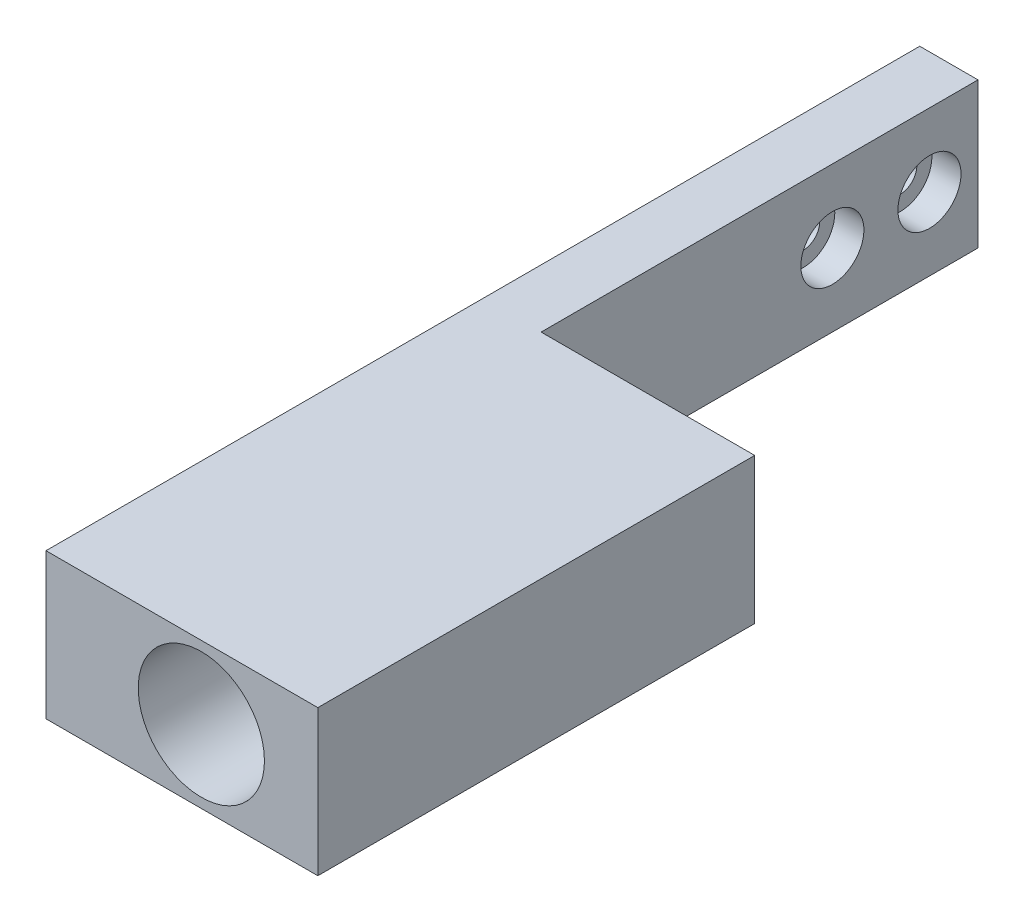
ISO-10303-21;
HEADER;
FILE_DESCRIPTION(('STEP AP214'),'2;1');
FILE_NAME('part.step','',(''),(''),'','','');
FILE_SCHEMA(('AUTOMOTIVE_DESIGN { 1 0 10303 214 1 1 1 1 }'));
ENDSEC;
DATA;
#1=APPLICATION_CONTEXT('core data for automotive mechanical design processes');
#2=APPLICATION_PROTOCOL_DEFINITION('international standard','automotive_design',2000,#1);
#3=PRODUCT_CONTEXT('',#1,'mechanical');
#4=PRODUCT('Part','Part','',(#3));
#5=PRODUCT_RELATED_PRODUCT_CATEGORY('part','',(#4));
#6=PRODUCT_DEFINITION_FORMATION('','',#4);
#7=PRODUCT_DEFINITION_CONTEXT('part definition',#1,'design');
#8=PRODUCT_DEFINITION('design','',#6,#7);
#9=PRODUCT_DEFINITION_SHAPE('','',#8);
#10=(LENGTH_UNIT() NAMED_UNIT(*) SI_UNIT(.MILLI.,.METRE.));
#11=(NAMED_UNIT(*) PLANE_ANGLE_UNIT() SI_UNIT($,.RADIAN.));
#12=(NAMED_UNIT(*) SI_UNIT($,.STERADIAN.) SOLID_ANGLE_UNIT());
#13=UNCERTAINTY_MEASURE_WITH_UNIT(LENGTH_MEASURE(1.E-05),#10,'distance_accuracy_value','');
#14=(GEOMETRIC_REPRESENTATION_CONTEXT(3) GLOBAL_UNCERTAINTY_ASSIGNED_CONTEXT((#13)) GLOBAL_UNIT_ASSIGNED_CONTEXT((#10,
#11,#12)) REPRESENTATION_CONTEXT('',''));
#15=CARTESIAN_POINT('',(0.,0.,0.));
#16=DIRECTION('',(0.,0.,1.));
#17=DIRECTION('',(1.,0.,0.));
#18=AXIS2_PLACEMENT_3D('',#15,#16,#17);
#19=CARTESIAN_POINT('',(115.8,0.,0.));
#20=DIRECTION('',(-1.,0.,0.));
#21=DIRECTION('',(0.,0.,1.));
#22=AXIS2_PLACEMENT_3D('',#19,#20,#21);
#23=PLANE('',#22);
#24=CARTESIAN_POINT('',(115.8,0.,5.));
#25=DIRECTION('',(1.,0.,0.));
#26=DIRECTION('',(0.,0.,-1.));
#27=AXIS2_PLACEMENT_3D('',#24,#25,#26);
#28=CIRCLE('',#27,3.25);
#29=CARTESIAN_POINT('',(115.8,0.,1.75));
#30=VERTEX_POINT('',#29);
#31=EDGE_CURVE('E191',#30,#30,#28,.T.);
#32=ORIENTED_EDGE('',*,*,#31,.F.);
#33=EDGE_LOOP('',(#32));
#34=FACE_BOUND('',#33,.T.);
#35=DIRECTION('',(0.,0.,1.));
#36=VECTOR('',#35,1.);
#37=CARTESIAN_POINT('',(115.8,7.5,10.));
#38=LINE('',#37,#36);
#39=CARTESIAN_POINT('',(115.8,7.5,-10.));
#40=VERTEX_POINT('',#39);
#41=CARTESIAN_POINT('',(115.8,7.5,35.));
#42=VERTEX_POINT('',#41);
#43=EDGE_CURVE('E142',#40,#42,#38,.T.);
#44=ORIENTED_EDGE('',*,*,#43,.T.);
#45=DIRECTION('',(0.,-1.,0.));
#46=VECTOR('',#45,1.);
#47=CARTESIAN_POINT('',(115.8,0.,35.));
#48=LINE('',#47,#46);
#49=CARTESIAN_POINT('',(115.8,-7.5,35.));
#50=VERTEX_POINT('',#49);
#51=EDGE_CURVE('E113',#42,#50,#48,.T.);
#52=ORIENTED_EDGE('',*,*,#51,.T.);
#53=DIRECTION('',(0.,0.,-1.));
#54=VECTOR('',#53,1.);
#55=CARTESIAN_POINT('',(115.8,-7.5,10.));
#56=LINE('',#55,#54);
#57=CARTESIAN_POINT('',(115.8,-7.5,-10.));
#58=VERTEX_POINT('',#57);
#59=EDGE_CURVE('E100',#50,#58,#56,.T.);
#60=ORIENTED_EDGE('',*,*,#59,.T.);
#61=DIRECTION('',(0.,1.,0.));
#62=VECTOR('',#61,1.);
#63=CARTESIAN_POINT('',(115.8,-7.5,-10.));
#64=LINE('',#63,#62);
#65=EDGE_CURVE('E139',#58,#40,#64,.T.);
#66=ORIENTED_EDGE('',*,*,#65,.T.);
#67=EDGE_LOOP('',(#44,#52,#60,#66));
#68=FACE_BOUND('',#67,.T.);
#69=CARTESIAN_POINT('',(115.8,0.,-5.00000000000001));
#70=DIRECTION('',(1.,0.,0.));
#71=DIRECTION('',(0.,0.,-1.));
#72=AXIS2_PLACEMENT_3D('',#69,#70,#71);
#73=CIRCLE('',#72,3.25);
#74=CARTESIAN_POINT('',(115.8,0.,-8.25));
#75=VERTEX_POINT('',#74);
#76=EDGE_CURVE('E181',#75,#75,#73,.T.);
#77=ORIENTED_EDGE('',*,*,#76,.F.);
#78=EDGE_LOOP('',(#77));
#79=FACE_BOUND('',#78,.T.);
#80=ADVANCED_FACE('F42',(#34,#68,#79),#23,.F.);
#81=CARTESIAN_POINT('',(109.8,7.5,45.));
#82=DIRECTION('',(1.,0.,0.));
#83=DIRECTION('',(0.,0.,-1.));
#84=AXIS2_PLACEMENT_3D('',#81,#82,#83);
#85=PLANE('',#84);
#86=CARTESIAN_POINT('',(109.8,0.,5.));
#87=DIRECTION('',(1.,0.,0.));
#88=DIRECTION('',(0.,0.,-1.));
#89=AXIS2_PLACEMENT_3D('',#86,#87,#88);
#90=CIRCLE('',#89,1.7);
#91=CARTESIAN_POINT('',(109.8,0.,3.3));
#92=VERTEX_POINT('',#91);
#93=EDGE_CURVE('E183',#92,#92,#90,.F.);
#94=ORIENTED_EDGE('',*,*,#93,.F.);
#95=EDGE_LOOP('',(#94));
#96=FACE_BOUND('',#95,.T.);
#97=DIRECTION('',(0.,0.,-1.));
#98=VECTOR('',#97,1.);
#99=CARTESIAN_POINT('',(109.8,7.5,45.));
#100=LINE('',#99,#98);
#101=CARTESIAN_POINT('',(109.8,7.5,80.));
#102=VERTEX_POINT('',#101);
#103=CARTESIAN_POINT('',(109.8,7.5,-10.));
#104=VERTEX_POINT('',#103);
#105=EDGE_CURVE('E57',#102,#104,#100,.T.);
#106=ORIENTED_EDGE('',*,*,#105,.T.);
#107=DIRECTION('',(0.,1.,0.));
#108=VECTOR('',#107,1.);
#109=CARTESIAN_POINT('',(109.8,-7.5,-10.));
#110=LINE('',#109,#108);
#111=CARTESIAN_POINT('',(109.8,-7.5,-10.));
#112=VERTEX_POINT('',#111);
#113=EDGE_CURVE('E11',#112,#104,#110,.T.);
#114=ORIENTED_EDGE('',*,*,#113,.F.);
#115=DIRECTION('',(0.,0.,-1.));
#116=VECTOR('',#115,1.);
#117=CARTESIAN_POINT('',(109.8,-7.5,45.));
#118=LINE('',#117,#116);
#119=CARTESIAN_POINT('',(109.8,-7.5,80.));
#120=VERTEX_POINT('',#119);
#121=EDGE_CURVE('E64',#120,#112,#118,.T.);
#122=ORIENTED_EDGE('',*,*,#121,.F.);
#123=DIRECTION('',(0.,-1.,0.));
#124=VECTOR('',#123,1.);
#125=CARTESIAN_POINT('',(109.8,-7.5,80.));
#126=LINE('',#125,#124);
#127=EDGE_CURVE('E126',#102,#120,#126,.T.);
#128=ORIENTED_EDGE('',*,*,#127,.F.);
#129=EDGE_LOOP('',(#106,#114,#122,#128));
#130=FACE_BOUND('',#129,.T.);
#131=CARTESIAN_POINT('',(109.8,0.,-5.00000000000001));
#132=DIRECTION('',(1.,0.,0.));
#133=DIRECTION('',(0.,0.,-1.));
#134=AXIS2_PLACEMENT_3D('',#131,#132,#133);
#135=CIRCLE('',#134,1.7);
#136=CARTESIAN_POINT('',(109.8,0.,-6.7));
#137=VERTEX_POINT('',#136);
#138=EDGE_CURVE('E171',#137,#137,#135,.F.);
#139=ORIENTED_EDGE('',*,*,#138,.F.);
#140=EDGE_LOOP('',(#139));
#141=FACE_BOUND('',#140,.T.);
#142=ADVANCED_FACE('F154',(#96,#130,#141),#85,.F.);
#143=CARTESIAN_POINT('',(125.8,0.,80.));
#144=DIRECTION('',(0.,0.,-1.));
#145=DIRECTION('',(-1.,0.,0.));
#146=AXIS2_PLACEMENT_3D('',#143,#144,#145);
#147=CYLINDRICAL_SURFACE('',#146,6.50000000000002);
#148=CARTESIAN_POINT('',(125.8,0.,80.));
#149=DIRECTION('',(0.,0.,1.));
#150=DIRECTION('',(1.,0.,0.));
#151=AXIS2_PLACEMENT_3D('',#148,#149,#150);
#152=CIRCLE('',#151,6.50000000000002);
#153=CARTESIAN_POINT('',(132.3,0.,80.));
#154=VERTEX_POINT('',#153);
#155=EDGE_CURVE('E120',#154,#154,#152,.T.);
#156=ORIENTED_EDGE('',*,*,#155,.T.);
#157=EDGE_LOOP('',(#156));
#158=FACE_BOUND('',#157,.T.);
#159=CARTESIAN_POINT('',(125.8,0.,35.));
#160=DIRECTION('',(0.,0.,1.));
#161=DIRECTION('',(1.,0.,0.));
#162=AXIS2_PLACEMENT_3D('',#159,#160,#161);
#163=CIRCLE('',#162,6.50000000000002);
#164=CARTESIAN_POINT('',(132.3,0.,35.));
#165=VERTEX_POINT('',#164);
#166=EDGE_CURVE('E105',#165,#165,#163,.T.);
#167=ORIENTED_EDGE('',*,*,#166,.F.);
#168=EDGE_LOOP('',(#167));
#169=FACE_BOUND('',#168,.T.);
#170=ADVANCED_FACE('F163',(#158,#169),#147,.F.);
#171=CARTESIAN_POINT('',(137.8,-7.5,80.));
#172=DIRECTION('',(-1.,0.,0.));
#173=DIRECTION('',(0.,-1.,0.));
#174=AXIS2_PLACEMENT_3D('',#171,#172,#173);
#175=PLANE('',#174);
#176=DIRECTION('',(0.,0.,-1.));
#177=VECTOR('',#176,1.);
#178=CARTESIAN_POINT('',(137.8,-7.5,80.));
#179=LINE('',#178,#177);
#180=CARTESIAN_POINT('',(137.8,-7.5,80.));
#181=VERTEX_POINT('',#180);
#182=CARTESIAN_POINT('',(137.8,-7.5,35.));
#183=VERTEX_POINT('',#182);
#184=EDGE_CURVE('E98',#181,#183,#179,.T.);
#185=ORIENTED_EDGE('',*,*,#184,.T.);
#186=DIRECTION('',(0.,1.,0.));
#187=VECTOR('',#186,1.);
#188=CARTESIAN_POINT('',(137.8,-7.5,35.));
#189=LINE('',#188,#187);
#190=CARTESIAN_POINT('',(137.8,7.5,35.));
#191=VERTEX_POINT('',#190);
#192=EDGE_CURVE('E104',#183,#191,#189,.T.);
#193=ORIENTED_EDGE('',*,*,#192,.T.);
#194=DIRECTION('',(0.,0.,-1.));
#195=VECTOR('',#194,1.);
#196=CARTESIAN_POINT('',(137.8,7.5,80.));
#197=LINE('',#196,#195);
#198=CARTESIAN_POINT('',(137.8,7.5,80.));
#199=VERTEX_POINT('',#198);
#200=EDGE_CURVE('E114',#199,#191,#197,.T.);
#201=ORIENTED_EDGE('',*,*,#200,.F.);
#202=DIRECTION('',(0.,1.,0.));
#203=VECTOR('',#202,1.);
#204=CARTESIAN_POINT('',(137.8,-7.5,80.));
#205=LINE('',#204,#203);
#206=EDGE_CURVE('E112',#181,#199,#205,.T.);
#207=ORIENTED_EDGE('',*,*,#206,.F.);
#208=EDGE_LOOP('',(#185,#193,#201,#207));
#209=FACE_BOUND('',#208,.T.);
#210=ADVANCED_FACE('F109',(#209),#175,.F.);
#211=CARTESIAN_POINT('',(0.,0.,35.));
#212=DIRECTION('',(0.,0.,-1.));
#213=DIRECTION('',(-1.,0.,0.));
#214=AXIS2_PLACEMENT_3D('',#211,#212,#213);
#215=PLANE('',#214);
#216=ORIENTED_EDGE('',*,*,#166,.T.);
#217=EDGE_LOOP('',(#216));
#218=FACE_BOUND('',#217,.T.);
#219=ORIENTED_EDGE('',*,*,#51,.F.);
#220=DIRECTION('',(-1.,0.,0.));
#221=VECTOR('',#220,1.);
#222=CARTESIAN_POINT('',(109.8,7.5,35.));
#223=LINE('',#222,#221);
#224=EDGE_CURVE('E118',#191,#42,#223,.T.);
#225=ORIENTED_EDGE('',*,*,#224,.F.);
#226=ORIENTED_EDGE('',*,*,#192,.F.);
#227=DIRECTION('',(1.,0.,0.));
#228=VECTOR('',#227,1.);
#229=CARTESIAN_POINT('',(109.8,-7.5,35.));
#230=LINE('',#229,#228);
#231=EDGE_CURVE('E95',#50,#183,#230,.T.);
#232=ORIENTED_EDGE('',*,*,#231,.F.);
#233=EDGE_LOOP('',(#219,#225,#226,#232));
#234=FACE_BOUND('',#233,.T.);
#235=ADVANCED_FACE('F116',(#218,#234),#215,.T.);
#236=CARTESIAN_POINT('',(115.8,-7.5,-10.));
#237=DIRECTION('',(0.,0.,1.));
#238=DIRECTION('',(1.,0.,0.));
#239=AXIS2_PLACEMENT_3D('',#236,#237,#238);
#240=PLANE('',#239);
#241=DIRECTION('',(-1.,0.,0.));
#242=VECTOR('',#241,1.);
#243=CARTESIAN_POINT('',(115.8,-7.5,-10.));
#244=LINE('',#243,#242);
#245=EDGE_CURVE('E145',#58,#112,#244,.T.);
#246=ORIENTED_EDGE('',*,*,#245,.T.);
#247=ORIENTED_EDGE('',*,*,#113,.T.);
#248=DIRECTION('',(-1.,0.,0.));
#249=VECTOR('',#248,1.);
#250=CARTESIAN_POINT('',(115.8,7.5,-10.));
#251=LINE('',#250,#249);
#252=EDGE_CURVE('E50',#40,#104,#251,.T.);
#253=ORIENTED_EDGE('',*,*,#252,.F.);
#254=ORIENTED_EDGE('',*,*,#65,.F.);
#255=EDGE_LOOP('',(#246,#247,#253,#254));
#256=FACE_BOUND('',#255,.T.);
#257=ADVANCED_FACE('F44',(#256),#240,.F.);
#258=CARTESIAN_POINT('',(115.8,7.5,10.));
#259=DIRECTION('',(0.,-1.,0.));
#260=DIRECTION('',(0.,0.,-1.));
#261=AXIS2_PLACEMENT_3D('',#258,#259,#260);
#262=PLANE('',#261);
#263=ORIENTED_EDGE('',*,*,#252,.T.);
#264=ORIENTED_EDGE('',*,*,#105,.F.);
#265=DIRECTION('',(-1.,0.,0.));
#266=VECTOR('',#265,1.);
#267=CARTESIAN_POINT('',(109.8,7.5,80.));
#268=LINE('',#267,#266);
#269=EDGE_CURVE('E132',#199,#102,#268,.T.);
#270=ORIENTED_EDGE('',*,*,#269,.F.);
#271=ORIENTED_EDGE('',*,*,#200,.T.);
#272=ORIENTED_EDGE('',*,*,#224,.T.);
#273=ORIENTED_EDGE('',*,*,#43,.F.);
#274=EDGE_LOOP('',(#263,#264,#270,#271,#272,#273));
#275=FACE_BOUND('',#274,.T.);
#276=ADVANCED_FACE('F150',(#275),#262,.F.);
#277=CARTESIAN_POINT('',(0.,0.,80.));
#278=DIRECTION('',(0.,0.,-1.));
#279=DIRECTION('',(-1.,0.,0.));
#280=AXIS2_PLACEMENT_3D('',#277,#278,#279);
#281=PLANE('',#280);
#282=ORIENTED_EDGE('',*,*,#127,.T.);
#283=DIRECTION('',(1.,0.,0.));
#284=VECTOR('',#283,1.);
#285=CARTESIAN_POINT('',(109.8,-7.5,80.));
#286=LINE('',#285,#284);
#287=EDGE_CURVE('E129',#120,#181,#286,.T.);
#288=ORIENTED_EDGE('',*,*,#287,.T.);
#289=ORIENTED_EDGE('',*,*,#206,.T.);
#290=ORIENTED_EDGE('',*,*,#269,.T.);
#291=EDGE_LOOP('',(#282,#288,#289,#290));
#292=FACE_BOUND('',#291,.T.);
#293=ORIENTED_EDGE('',*,*,#155,.F.);
#294=EDGE_LOOP('',(#293));
#295=FACE_BOUND('',#294,.T.);
#296=ADVANCED_FACE('F157',(#292,#295),#281,.F.);
#297=CARTESIAN_POINT('',(115.8,-7.5,10.));
#298=DIRECTION('',(0.,1.,0.));
#299=DIRECTION('',(0.,0.,1.));
#300=AXIS2_PLACEMENT_3D('',#297,#298,#299);
#301=PLANE('',#300);
#302=ORIENTED_EDGE('',*,*,#121,.T.);
#303=ORIENTED_EDGE('',*,*,#245,.F.);
#304=ORIENTED_EDGE('',*,*,#59,.F.);
#305=ORIENTED_EDGE('',*,*,#231,.T.);
#306=ORIENTED_EDGE('',*,*,#184,.F.);
#307=ORIENTED_EDGE('',*,*,#287,.F.);
#308=EDGE_LOOP('',(#302,#303,#304,#305,#306,#307));
#309=FACE_BOUND('',#308,.T.);
#310=ADVANCED_FACE('F97',(#309),#301,.F.);
#311=CARTESIAN_POINT('',(115.8,0.,-5.00000000000001));
#312=DIRECTION('',(1.,0.,0.));
#313=DIRECTION('',(0.,0.,-1.));
#314=AXIS2_PLACEMENT_3D('',#311,#312,#313);
#315=CYLINDRICAL_SURFACE('',#314,1.7);
#316=ORIENTED_EDGE('',*,*,#138,.T.);
#317=EDGE_LOOP('',(#316));
#318=FACE_BOUND('',#317,.T.);
#319=CARTESIAN_POINT('',(112.8,0.,-5.00000000000001));
#320=DIRECTION('',(1.,0.,0.));
#321=DIRECTION('',(0.,0.,-1.));
#322=AXIS2_PLACEMENT_3D('',#319,#320,#321);
#323=CIRCLE('',#322,1.7);
#324=CARTESIAN_POINT('',(112.8,0.,-6.7));
#325=VERTEX_POINT('',#324);
#326=EDGE_CURVE('E173',#325,#325,#323,.T.);
#327=ORIENTED_EDGE('',*,*,#326,.T.);
#328=EDGE_LOOP('',(#327));
#329=FACE_BOUND('',#328,.T.);
#330=ADVANCED_FACE('F167',(#318,#329),#315,.F.);
#331=CARTESIAN_POINT('',(112.8,1.7,-5.00000000000001));
#332=DIRECTION('',(-1.,0.,0.));
#333=DIRECTION('',(0.,0.,1.));
#334=AXIS2_PLACEMENT_3D('',#331,#332,#333);
#335=PLANE('',#334);
#336=ORIENTED_EDGE('',*,*,#326,.F.);
#337=EDGE_LOOP('',(#336));
#338=FACE_BOUND('',#337,.T.);
#339=CARTESIAN_POINT('',(112.8,0.,-5.00000000000001));
#340=DIRECTION('',(1.,0.,0.));
#341=DIRECTION('',(0.,0.,-1.));
#342=AXIS2_PLACEMENT_3D('',#339,#340,#341);
#343=CIRCLE('',#342,3.25);
#344=CARTESIAN_POINT('',(112.8,0.,-8.25));
#345=VERTEX_POINT('',#344);
#346=EDGE_CURVE('E178',#345,#345,#343,.T.);
#347=ORIENTED_EDGE('',*,*,#346,.T.);
#348=EDGE_LOOP('',(#347));
#349=FACE_BOUND('',#348,.T.);
#350=ADVANCED_FACE('F215',(#338,#349),#335,.F.);
#351=CARTESIAN_POINT('',(115.8,0.,-5.00000000000001));
#352=DIRECTION('',(1.,0.,0.));
#353=DIRECTION('',(0.,0.,-1.));
#354=AXIS2_PLACEMENT_3D('',#351,#352,#353);
#355=CYLINDRICAL_SURFACE('',#354,3.25);
#356=ORIENTED_EDGE('',*,*,#346,.F.);
#357=EDGE_LOOP('',(#356));
#358=FACE_BOUND('',#357,.T.);
#359=ORIENTED_EDGE('',*,*,#76,.T.);
#360=EDGE_LOOP('',(#359));
#361=FACE_BOUND('',#360,.T.);
#362=ADVANCED_FACE('F233',(#358,#361),#355,.F.);
#363=CARTESIAN_POINT('',(115.8,0.,5.));
#364=DIRECTION('',(1.,0.,0.));
#365=DIRECTION('',(0.,0.,-1.));
#366=AXIS2_PLACEMENT_3D('',#363,#364,#365);
#367=CYLINDRICAL_SURFACE('',#366,1.7);
#368=ORIENTED_EDGE('',*,*,#93,.T.);
#369=EDGE_LOOP('',(#368));
#370=FACE_BOUND('',#369,.T.);
#371=CARTESIAN_POINT('',(112.8,0.,5.));
#372=DIRECTION('',(1.,0.,0.));
#373=DIRECTION('',(0.,0.,-1.));
#374=AXIS2_PLACEMENT_3D('',#371,#372,#373);
#375=CIRCLE('',#374,1.7);
#376=CARTESIAN_POINT('',(112.8,0.,3.3));
#377=VERTEX_POINT('',#376);
#378=EDGE_CURVE('E185',#377,#377,#375,.T.);
#379=ORIENTED_EDGE('',*,*,#378,.T.);
#380=EDGE_LOOP('',(#379));
#381=FACE_BOUND('',#380,.T.);
#382=ADVANCED_FACE('F197',(#370,#381),#367,.F.);
#383=CARTESIAN_POINT('',(112.8,1.7,5.));
#384=DIRECTION('',(-1.,0.,0.));
#385=DIRECTION('',(0.,0.,1.));
#386=AXIS2_PLACEMENT_3D('',#383,#384,#385);
#387=PLANE('',#386);
#388=ORIENTED_EDGE('',*,*,#378,.F.);
#389=EDGE_LOOP('',(#388));
#390=FACE_BOUND('',#389,.T.);
#391=CARTESIAN_POINT('',(112.8,0.,5.));
#392=DIRECTION('',(1.,0.,0.));
#393=DIRECTION('',(0.,0.,-1.));
#394=AXIS2_PLACEMENT_3D('',#391,#392,#393);
#395=CIRCLE('',#394,3.25);
#396=CARTESIAN_POINT('',(112.8,0.,1.75));
#397=VERTEX_POINT('',#396);
#398=EDGE_CURVE('E188',#397,#397,#395,.T.);
#399=ORIENTED_EDGE('',*,*,#398,.T.);
#400=EDGE_LOOP('',(#399));
#401=FACE_BOUND('',#400,.T.);
#402=ADVANCED_FACE('F240',(#390,#401),#387,.F.);
#403=CARTESIAN_POINT('',(115.8,0.,5.));
#404=DIRECTION('',(1.,0.,0.));
#405=DIRECTION('',(0.,0.,-1.));
#406=AXIS2_PLACEMENT_3D('',#403,#404,#405);
#407=CYLINDRICAL_SURFACE('',#406,3.25);
#408=ORIENTED_EDGE('',*,*,#398,.F.);
#409=EDGE_LOOP('',(#408));
#410=FACE_BOUND('',#409,.T.);
#411=ORIENTED_EDGE('',*,*,#31,.T.);
#412=EDGE_LOOP('',(#411));
#413=FACE_BOUND('',#412,.T.);
#414=ADVANCED_FACE('F243',(#410,#413),#407,.F.);
#415=CLOSED_SHELL('',(#80,#142,#170,#210,#235,#257,#276,#296,#310,#330,#350,#362,#382,#402,#414));
#416=MANIFOLD_SOLID_BREP('B2',#415);
#417=ADVANCED_BREP_SHAPE_REPRESENTATION('',(#18,#416),#14);
#418=SHAPE_DEFINITION_REPRESENTATION(#9,#417);
ENDSEC;
END-ISO-10303-21;
